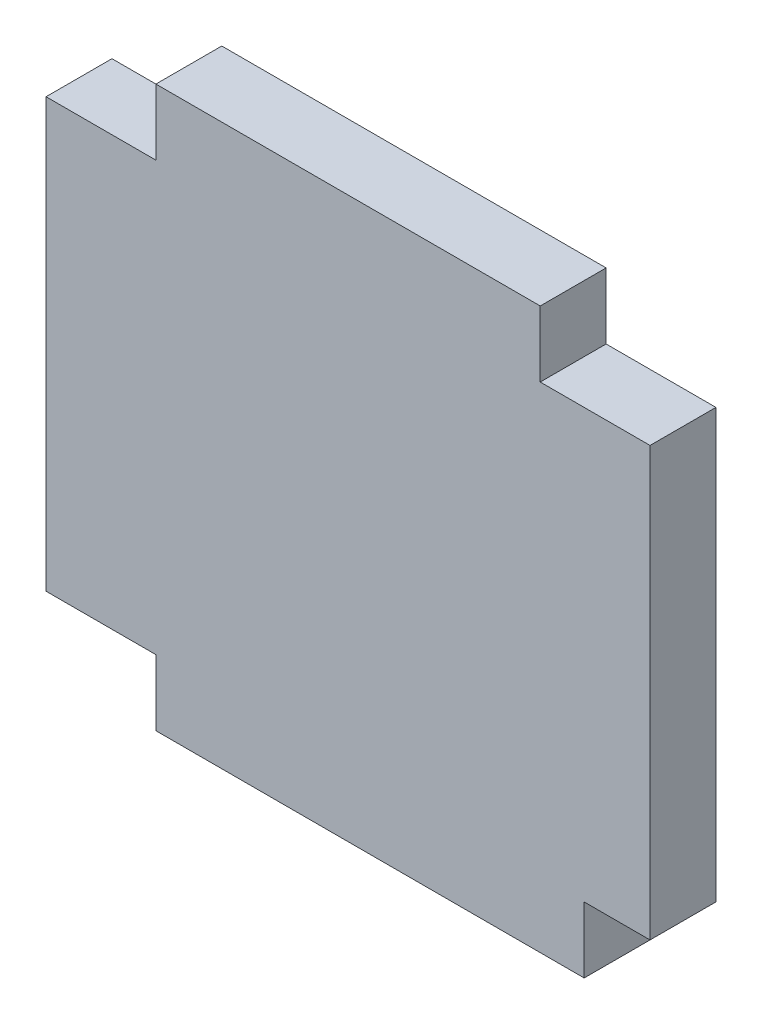
ISO-10303-21;
HEADER;
FILE_DESCRIPTION(('STEP AP214'),'2;1');
FILE_NAME('part.step','',(''),(''),'','','');
FILE_SCHEMA(('AUTOMOTIVE_DESIGN { 1 0 10303 214 1 1 1 1 }'));
ENDSEC;
DATA;
#1=APPLICATION_CONTEXT('core data for automotive mechanical design processes');
#2=APPLICATION_PROTOCOL_DEFINITION('international standard','automotive_design',2000,#1);
#3=PRODUCT_CONTEXT('',#1,'mechanical');
#4=PRODUCT('Part','Part','',(#3));
#5=PRODUCT_RELATED_PRODUCT_CATEGORY('part','',(#4));
#6=PRODUCT_DEFINITION_FORMATION('','',#4);
#7=PRODUCT_DEFINITION_CONTEXT('part definition',#1,'design');
#8=PRODUCT_DEFINITION('design','',#6,#7);
#9=PRODUCT_DEFINITION_SHAPE('','',#8);
#10=(LENGTH_UNIT() NAMED_UNIT(*) SI_UNIT(.MILLI.,.METRE.));
#11=(NAMED_UNIT(*) PLANE_ANGLE_UNIT() SI_UNIT($,.RADIAN.));
#12=(NAMED_UNIT(*) SI_UNIT($,.STERADIAN.) SOLID_ANGLE_UNIT());
#13=UNCERTAINTY_MEASURE_WITH_UNIT(LENGTH_MEASURE(1.E-05),#10,'distance_accuracy_value','');
#14=(GEOMETRIC_REPRESENTATION_CONTEXT(3) GLOBAL_UNCERTAINTY_ASSIGNED_CONTEXT((#13)) GLOBAL_UNIT_ASSIGNED_CONTEXT((#10,
#11,#12)) REPRESENTATION_CONTEXT('',''));
#15=CARTESIAN_POINT('',(0.,0.,0.));
#16=DIRECTION('',(0.,0.,1.));
#17=DIRECTION('',(1.,0.,0.));
#18=AXIS2_PLACEMENT_3D('',#15,#16,#17);
#19=CARTESIAN_POINT('',(0.,45.,6.));
#20=DIRECTION('',(1.,0.,0.));
#21=DIRECTION('',(0.,1.,0.));
#22=AXIS2_PLACEMENT_3D('',#19,#20,#21);
#23=PLANE('',#22);
#24=DIRECTION('',(0.,-1.,0.));
#25=VECTOR('',#24,1.);
#26=CARTESIAN_POINT('',(0.,45.,6.));
#27=LINE('',#26,#25);
#28=CARTESIAN_POINT('',(0.,39.,6.));
#29=VERTEX_POINT('',#28);
#30=CARTESIAN_POINT('',(0.,0.,6.));
#31=VERTEX_POINT('',#30);
#32=EDGE_CURVE('E136',#29,#31,#27,.T.);
#33=ORIENTED_EDGE('',*,*,#32,.F.);
#34=DIRECTION('',(0.,0.,1.));
#35=VECTOR('',#34,1.);
#36=CARTESIAN_POINT('',(0.,39.,0.));
#37=LINE('',#36,#35);
#38=CARTESIAN_POINT('',(0.,39.,0.));
#39=VERTEX_POINT('',#38);
#40=EDGE_CURVE('E124',#39,#29,#37,.T.);
#41=ORIENTED_EDGE('',*,*,#40,.F.);
#42=DIRECTION('',(0.,-1.,0.));
#43=VECTOR('',#42,1.);
#44=CARTESIAN_POINT('',(0.,45.,0.));
#45=LINE('',#44,#43);
#46=CARTESIAN_POINT('',(0.,0.,0.));
#47=VERTEX_POINT('',#46);
#48=EDGE_CURVE('E134',#39,#47,#45,.T.);
#49=ORIENTED_EDGE('',*,*,#48,.T.);
#50=DIRECTION('',(0.,0.,-1.));
#51=VECTOR('',#50,1.);
#52=CARTESIAN_POINT('',(0.,0.,6.));
#53=LINE('',#52,#51);
#54=EDGE_CURVE('E11',#31,#47,#53,.T.);
#55=ORIENTED_EDGE('',*,*,#54,.F.);
#56=EDGE_LOOP('',(#33,#41,#49,#55));
#57=FACE_BOUND('',#56,.T.);
#58=ADVANCED_FACE('F33',(#57),#23,.F.);
#59=CARTESIAN_POINT('',(0.,0.,6.));
#60=DIRECTION('',(0.,1.,0.));
#61=DIRECTION('',(0.,0.,1.));
#62=AXIS2_PLACEMENT_3D('',#59,#60,#61);
#63=PLANE('',#62);
#64=DIRECTION('',(1.,0.,0.));
#65=VECTOR('',#64,1.);
#66=CARTESIAN_POINT('',(0.,0.,0.));
#67=LINE('',#66,#65);
#68=CARTESIAN_POINT('',(10.,0.,0.));
#69=VERTEX_POINT('',#68);
#70=EDGE_CURVE('E140',#47,#69,#67,.T.);
#71=ORIENTED_EDGE('',*,*,#70,.T.);
#72=DIRECTION('',(0.,0.,-1.));
#73=VECTOR('',#72,1.);
#74=CARTESIAN_POINT('',(10.,0.,6.));
#75=LINE('',#74,#73);
#76=CARTESIAN_POINT('',(10.,0.,6.));
#77=VERTEX_POINT('',#76);
#78=EDGE_CURVE('E40',#77,#69,#75,.T.);
#79=ORIENTED_EDGE('',*,*,#78,.F.);
#80=DIRECTION('',(1.,0.,0.));
#81=VECTOR('',#80,1.);
#82=CARTESIAN_POINT('',(0.,0.,6.));
#83=LINE('',#82,#81);
#84=EDGE_CURVE('E241',#31,#77,#83,.T.);
#85=ORIENTED_EDGE('',*,*,#84,.F.);
#86=ORIENTED_EDGE('',*,*,#54,.T.);
#87=EDGE_LOOP('',(#71,#79,#85,#86));
#88=FACE_BOUND('',#87,.T.);
#89=ADVANCED_FACE('F242',(#88),#63,.F.);
#90=CARTESIAN_POINT('',(10.,-6.,6.));
#91=DIRECTION('',(1.,0.,0.));
#92=DIRECTION('',(0.,0.,-1.));
#93=AXIS2_PLACEMENT_3D('',#90,#91,#92);
#94=PLANE('',#93);
#95=DIRECTION('',(0.,-1.,0.));
#96=VECTOR('',#95,1.);
#97=CARTESIAN_POINT('',(10.,-6.,0.));
#98=LINE('',#97,#96);
#99=CARTESIAN_POINT('',(10.,-6.,0.));
#100=VERTEX_POINT('',#99);
#101=EDGE_CURVE('E143',#69,#100,#98,.T.);
#102=ORIENTED_EDGE('',*,*,#101,.T.);
#103=DIRECTION('',(0.,0.,-1.));
#104=VECTOR('',#103,1.);
#105=CARTESIAN_POINT('',(10.,-6.,6.));
#106=LINE('',#105,#104);
#107=CARTESIAN_POINT('',(10.,-6.,6.));
#108=VERTEX_POINT('',#107);
#109=EDGE_CURVE('E173',#108,#100,#106,.T.);
#110=ORIENTED_EDGE('',*,*,#109,.F.);
#111=DIRECTION('',(0.,-1.,0.));
#112=VECTOR('',#111,1.);
#113=CARTESIAN_POINT('',(10.,-6.,6.));
#114=LINE('',#113,#112);
#115=EDGE_CURVE('E181',#77,#108,#114,.T.);
#116=ORIENTED_EDGE('',*,*,#115,.F.);
#117=ORIENTED_EDGE('',*,*,#78,.T.);
#118=EDGE_LOOP('',(#102,#110,#116,#117));
#119=FACE_BOUND('',#118,.T.);
#120=ADVANCED_FACE('F179',(#119),#94,.F.);
#121=CARTESIAN_POINT('',(10.,-6.,6.));
#122=DIRECTION('',(0.,1.,0.));
#123=DIRECTION('',(0.,0.,1.));
#124=AXIS2_PLACEMENT_3D('',#121,#122,#123);
#125=PLANE('',#124);
#126=DIRECTION('',(1.,0.,0.));
#127=VECTOR('',#126,1.);
#128=CARTESIAN_POINT('',(10.,-6.,0.));
#129=LINE('',#128,#127);
#130=CARTESIAN_POINT('',(49.,-6.,0.));
#131=VERTEX_POINT('',#130);
#132=EDGE_CURVE('E152',#100,#131,#129,.T.);
#133=ORIENTED_EDGE('',*,*,#132,.T.);
#134=DIRECTION('',(0.,0.,-1.));
#135=VECTOR('',#134,1.);
#136=CARTESIAN_POINT('',(49.,-6.,6.));
#137=LINE('',#136,#135);
#138=CARTESIAN_POINT('',(49.,-6.,6.));
#139=VERTEX_POINT('',#138);
#140=EDGE_CURVE('E170',#139,#131,#137,.T.);
#141=ORIENTED_EDGE('',*,*,#140,.F.);
#142=DIRECTION('',(1.,0.,0.));
#143=VECTOR('',#142,1.);
#144=CARTESIAN_POINT('',(10.,-6.,6.));
#145=LINE('',#144,#143);
#146=EDGE_CURVE('E199',#108,#139,#145,.T.);
#147=ORIENTED_EDGE('',*,*,#146,.F.);
#148=ORIENTED_EDGE('',*,*,#109,.T.);
#149=EDGE_LOOP('',(#133,#141,#147,#148));
#150=FACE_BOUND('',#149,.T.);
#151=ADVANCED_FACE('F189',(#150),#125,.F.);
#152=CARTESIAN_POINT('',(49.,-6.,6.));
#153=DIRECTION('',(-1.,0.,0.));
#154=DIRECTION('',(0.,0.,1.));
#155=AXIS2_PLACEMENT_3D('',#152,#153,#154);
#156=PLANE('',#155);
#157=DIRECTION('',(0.,1.,0.));
#158=VECTOR('',#157,1.);
#159=CARTESIAN_POINT('',(49.,-6.,0.));
#160=LINE('',#159,#158);
#161=CARTESIAN_POINT('',(49.,0.,0.));
#162=VERTEX_POINT('',#161);
#163=EDGE_CURVE('E154',#131,#162,#160,.T.);
#164=ORIENTED_EDGE('',*,*,#163,.T.);
#165=DIRECTION('',(0.,0.,-1.));
#166=VECTOR('',#165,1.);
#167=CARTESIAN_POINT('',(49.,0.,6.));
#168=LINE('',#167,#166);
#169=CARTESIAN_POINT('',(49.,0.,6.));
#170=VERTEX_POINT('',#169);
#171=EDGE_CURVE('E167',#170,#162,#168,.T.);
#172=ORIENTED_EDGE('',*,*,#171,.F.);
#173=DIRECTION('',(0.,1.,0.));
#174=VECTOR('',#173,1.);
#175=CARTESIAN_POINT('',(49.,-6.,6.));
#176=LINE('',#175,#174);
#177=EDGE_CURVE('E195',#139,#170,#176,.T.);
#178=ORIENTED_EDGE('',*,*,#177,.F.);
#179=ORIENTED_EDGE('',*,*,#140,.T.);
#180=EDGE_LOOP('',(#164,#172,#178,#179));
#181=FACE_BOUND('',#180,.T.);
#182=ADVANCED_FACE('F193',(#181),#156,.F.);
#183=CARTESIAN_POINT('',(55.,0.,6.));
#184=DIRECTION('',(0.,1.,0.));
#185=DIRECTION('',(-1.,0.,0.));
#186=AXIS2_PLACEMENT_3D('',#183,#184,#185);
#187=PLANE('',#186);
#188=DIRECTION('',(1.,0.,0.));
#189=VECTOR('',#188,1.);
#190=CARTESIAN_POINT('',(55.,0.,0.));
#191=LINE('',#190,#189);
#192=CARTESIAN_POINT('',(55.,0.,0.));
#193=VERTEX_POINT('',#192);
#194=EDGE_CURVE('E156',#162,#193,#191,.T.);
#195=ORIENTED_EDGE('',*,*,#194,.T.);
#196=DIRECTION('',(0.,0.,-1.));
#197=VECTOR('',#196,1.);
#198=CARTESIAN_POINT('',(55.,0.,6.));
#199=LINE('',#198,#197);
#200=CARTESIAN_POINT('',(55.,0.,6.));
#201=VERTEX_POINT('',#200);
#202=EDGE_CURVE('E164',#201,#193,#199,.T.);
#203=ORIENTED_EDGE('',*,*,#202,.F.);
#204=DIRECTION('',(1.,0.,0.));
#205=VECTOR('',#204,1.);
#206=CARTESIAN_POINT('',(55.,0.,6.));
#207=LINE('',#206,#205);
#208=EDGE_CURVE('E198',#170,#201,#207,.T.);
#209=ORIENTED_EDGE('',*,*,#208,.F.);
#210=ORIENTED_EDGE('',*,*,#171,.T.);
#211=EDGE_LOOP('',(#195,#203,#209,#210));
#212=FACE_BOUND('',#211,.T.);
#213=ADVANCED_FACE('F255',(#212),#187,.F.);
#214=CARTESIAN_POINT('',(55.,45.,6.));
#215=DIRECTION('',(-1.,0.,0.));
#216=DIRECTION('',(0.,-1.,0.));
#217=AXIS2_PLACEMENT_3D('',#214,#215,#216);
#218=PLANE('',#217);
#219=DIRECTION('',(0.,1.,0.));
#220=VECTOR('',#219,1.);
#221=CARTESIAN_POINT('',(55.,45.,0.));
#222=LINE('',#221,#220);
#223=CARTESIAN_POINT('',(55.,39.,0.));
#224=VERTEX_POINT('',#223);
#225=EDGE_CURVE('E158',#193,#224,#222,.T.);
#226=ORIENTED_EDGE('',*,*,#225,.T.);
#227=DIRECTION('',(0.,0.,1.));
#228=VECTOR('',#227,1.);
#229=CARTESIAN_POINT('',(55.,39.,0.));
#230=LINE('',#229,#228);
#231=CARTESIAN_POINT('',(55.,39.,6.));
#232=VERTEX_POINT('',#231);
#233=EDGE_CURVE('E226',#224,#232,#230,.T.);
#234=ORIENTED_EDGE('',*,*,#233,.T.);
#235=DIRECTION('',(0.,1.,0.));
#236=VECTOR('',#235,1.);
#237=CARTESIAN_POINT('',(55.,45.,6.));
#238=LINE('',#237,#236);
#239=EDGE_CURVE('E201',#201,#232,#238,.T.);
#240=ORIENTED_EDGE('',*,*,#239,.F.);
#241=ORIENTED_EDGE('',*,*,#202,.T.);
#242=EDGE_LOOP('',(#226,#234,#240,#241));
#243=FACE_BOUND('',#242,.T.);
#244=ADVANCED_FACE('F258',(#243),#218,.F.);
#245=CARTESIAN_POINT('',(0.,45.,6.));
#246=DIRECTION('',(0.,-1.,0.));
#247=DIRECTION('',(0.,0.,-1.));
#248=AXIS2_PLACEMENT_3D('',#245,#246,#247);
#249=PLANE('',#248);
#250=DIRECTION('',(-1.,0.,0.));
#251=VECTOR('',#250,1.);
#252=CARTESIAN_POINT('',(0.,45.,0.));
#253=LINE('',#252,#251);
#254=CARTESIAN_POINT('',(45.,45.,0.));
#255=VERTEX_POINT('',#254);
#256=CARTESIAN_POINT('',(10.,45.,0.));
#257=VERTEX_POINT('',#256);
#258=EDGE_CURVE('E161',#255,#257,#253,.T.);
#259=ORIENTED_EDGE('',*,*,#258,.T.);
#260=DIRECTION('',(0.,0.,1.));
#261=VECTOR('',#260,1.);
#262=CARTESIAN_POINT('',(10.,45.,0.));
#263=LINE('',#262,#261);
#264=CARTESIAN_POINT('',(10.,45.,6.));
#265=VERTEX_POINT('',#264);
#266=EDGE_CURVE('E141',#257,#265,#263,.T.);
#267=ORIENTED_EDGE('',*,*,#266,.T.);
#268=DIRECTION('',(-1.,0.,0.));
#269=VECTOR('',#268,1.);
#270=CARTESIAN_POINT('',(0.,45.,6.));
#271=LINE('',#270,#269);
#272=CARTESIAN_POINT('',(45.,45.,6.));
#273=VERTEX_POINT('',#272);
#274=EDGE_CURVE('E148',#273,#265,#271,.T.);
#275=ORIENTED_EDGE('',*,*,#274,.F.);
#276=DIRECTION('',(0.,0.,1.));
#277=VECTOR('',#276,1.);
#278=CARTESIAN_POINT('',(45.,45.,0.));
#279=LINE('',#278,#277);
#280=EDGE_CURVE('E218',#255,#273,#279,.T.);
#281=ORIENTED_EDGE('',*,*,#280,.F.);
#282=EDGE_LOOP('',(#259,#267,#275,#281));
#283=FACE_BOUND('',#282,.T.);
#284=ADVANCED_FACE('F217',(#283),#249,.F.);
#285=CARTESIAN_POINT('',(0.,0.,6.));
#286=DIRECTION('',(0.,0.,1.));
#287=DIRECTION('',(1.,0.,0.));
#288=AXIS2_PLACEMENT_3D('',#285,#286,#287);
#289=PLANE('',#288);
#290=DIRECTION('',(0.,1.,0.));
#291=VECTOR('',#290,1.);
#292=CARTESIAN_POINT('',(10.,45.,6.));
#293=LINE('',#292,#291);
#294=CARTESIAN_POINT('',(10.,39.,6.));
#295=VERTEX_POINT('',#294);
#296=EDGE_CURVE('E129',#295,#265,#293,.T.);
#297=ORIENTED_EDGE('',*,*,#296,.F.);
#298=DIRECTION('',(1.,0.,0.));
#299=VECTOR('',#298,1.);
#300=CARTESIAN_POINT('',(0.,39.,6.));
#301=LINE('',#300,#299);
#302=EDGE_CURVE('E224',#29,#295,#301,.T.);
#303=ORIENTED_EDGE('',*,*,#302,.F.);
#304=ORIENTED_EDGE('',*,*,#32,.T.);
#305=ORIENTED_EDGE('',*,*,#84,.T.);
#306=ORIENTED_EDGE('',*,*,#115,.T.);
#307=ORIENTED_EDGE('',*,*,#146,.T.);
#308=ORIENTED_EDGE('',*,*,#177,.T.);
#309=ORIENTED_EDGE('',*,*,#208,.T.);
#310=ORIENTED_EDGE('',*,*,#239,.T.);
#311=DIRECTION('',(1.,0.,0.));
#312=VECTOR('',#311,1.);
#313=CARTESIAN_POINT('',(55.,39.,6.));
#314=LINE('',#313,#312);
#315=CARTESIAN_POINT('',(45.,39.,6.));
#316=VERTEX_POINT('',#315);
#317=EDGE_CURVE('E231',#316,#232,#314,.T.);
#318=ORIENTED_EDGE('',*,*,#317,.F.);
#319=DIRECTION('',(0.,-1.,0.));
#320=VECTOR('',#319,1.);
#321=CARTESIAN_POINT('',(45.,45.,6.));
#322=LINE('',#321,#320);
#323=EDGE_CURVE('E214',#273,#316,#322,.T.);
#324=ORIENTED_EDGE('',*,*,#323,.F.);
#325=ORIENTED_EDGE('',*,*,#274,.T.);
#326=EDGE_LOOP('',(#297,#303,#304,#305,#306,#307,#308,#309,#310,#318,#324,#325));
#327=FACE_BOUND('',#326,.T.);
#328=ADVANCED_FACE('F212',(#327),#289,.T.);
#329=CARTESIAN_POINT('',(0.,0.,0.));
#330=DIRECTION('',(0.,0.,1.));
#331=DIRECTION('',(1.,0.,0.));
#332=AXIS2_PLACEMENT_3D('',#329,#330,#331);
#333=PLANE('',#332);
#334=DIRECTION('',(1.,0.,0.));
#335=VECTOR('',#334,1.);
#336=CARTESIAN_POINT('',(0.,39.,0.));
#337=LINE('',#336,#335);
#338=CARTESIAN_POINT('',(10.,39.,0.));
#339=VERTEX_POINT('',#338);
#340=EDGE_CURVE('E120',#39,#339,#337,.T.);
#341=ORIENTED_EDGE('',*,*,#340,.T.);
#342=DIRECTION('',(0.,1.,0.));
#343=VECTOR('',#342,1.);
#344=CARTESIAN_POINT('',(10.,45.,0.));
#345=LINE('',#344,#343);
#346=EDGE_CURVE('E47',#339,#257,#345,.T.);
#347=ORIENTED_EDGE('',*,*,#346,.T.);
#348=ORIENTED_EDGE('',*,*,#258,.F.);
#349=DIRECTION('',(0.,-1.,0.));
#350=VECTOR('',#349,1.);
#351=CARTESIAN_POINT('',(45.,45.,0.));
#352=LINE('',#351,#350);
#353=CARTESIAN_POINT('',(45.,39.,0.));
#354=VERTEX_POINT('',#353);
#355=EDGE_CURVE('E229',#255,#354,#352,.T.);
#356=ORIENTED_EDGE('',*,*,#355,.T.);
#357=DIRECTION('',(1.,0.,0.));
#358=VECTOR('',#357,1.);
#359=CARTESIAN_POINT('',(55.,39.,0.));
#360=LINE('',#359,#358);
#361=EDGE_CURVE('E55',#354,#224,#360,.T.);
#362=ORIENTED_EDGE('',*,*,#361,.T.);
#363=ORIENTED_EDGE('',*,*,#225,.F.);
#364=ORIENTED_EDGE('',*,*,#194,.F.);
#365=ORIENTED_EDGE('',*,*,#163,.F.);
#366=ORIENTED_EDGE('',*,*,#132,.F.);
#367=ORIENTED_EDGE('',*,*,#101,.F.);
#368=ORIENTED_EDGE('',*,*,#70,.F.);
#369=ORIENTED_EDGE('',*,*,#48,.F.);
#370=EDGE_LOOP('',(#341,#347,#348,#356,#362,#363,#364,#365,#366,#367,#368,#369));
#371=FACE_BOUND('',#370,.T.);
#372=ADVANCED_FACE('F138',(#371),#333,.F.);
#373=CARTESIAN_POINT('',(55.,39.,0.));
#374=DIRECTION('',(0.,-1.,0.));
#375=DIRECTION('',(0.,0.,-1.));
#376=AXIS2_PLACEMENT_3D('',#373,#374,#375);
#377=PLANE('',#376);
#378=ORIENTED_EDGE('',*,*,#317,.T.);
#379=ORIENTED_EDGE('',*,*,#233,.F.);
#380=ORIENTED_EDGE('',*,*,#361,.F.);
#381=DIRECTION('',(0.,0.,1.));
#382=VECTOR('',#381,1.);
#383=CARTESIAN_POINT('',(45.,39.,0.));
#384=LINE('',#383,#382);
#385=EDGE_CURVE('E237',#354,#316,#384,.T.);
#386=ORIENTED_EDGE('',*,*,#385,.T.);
#387=EDGE_LOOP('',(#378,#379,#380,#386));
#388=FACE_BOUND('',#387,.T.);
#389=ADVANCED_FACE('F267',(#388),#377,.F.);
#390=CARTESIAN_POINT('',(45.,45.,0.));
#391=DIRECTION('',(-1.,0.,0.));
#392=DIRECTION('',(0.,0.,1.));
#393=AXIS2_PLACEMENT_3D('',#390,#391,#392);
#394=PLANE('',#393);
#395=ORIENTED_EDGE('',*,*,#323,.T.);
#396=ORIENTED_EDGE('',*,*,#385,.F.);
#397=ORIENTED_EDGE('',*,*,#355,.F.);
#398=ORIENTED_EDGE('',*,*,#280,.T.);
#399=EDGE_LOOP('',(#395,#396,#397,#398));
#400=FACE_BOUND('',#399,.T.);
#401=ADVANCED_FACE('F270',(#400),#394,.F.);
#402=CARTESIAN_POINT('',(10.,45.,0.));
#403=DIRECTION('',(1.,0.,0.));
#404=DIRECTION('',(0.,0.,-1.));
#405=AXIS2_PLACEMENT_3D('',#402,#403,#404);
#406=PLANE('',#405);
#407=ORIENTED_EDGE('',*,*,#296,.T.);
#408=ORIENTED_EDGE('',*,*,#266,.F.);
#409=ORIENTED_EDGE('',*,*,#346,.F.);
#410=DIRECTION('',(0.,0.,1.));
#411=VECTOR('',#410,1.);
#412=CARTESIAN_POINT('',(10.,39.,0.));
#413=LINE('',#412,#411);
#414=EDGE_CURVE('E126',#339,#295,#413,.T.);
#415=ORIENTED_EDGE('',*,*,#414,.T.);
#416=EDGE_LOOP('',(#407,#408,#409,#415));
#417=FACE_BOUND('',#416,.T.);
#418=ADVANCED_FACE('F220',(#417),#406,.F.);
#419=CARTESIAN_POINT('',(0.,39.,0.));
#420=DIRECTION('',(0.,-1.,0.));
#421=DIRECTION('',(0.,0.,-1.));
#422=AXIS2_PLACEMENT_3D('',#419,#420,#421);
#423=PLANE('',#422);
#424=ORIENTED_EDGE('',*,*,#302,.T.);
#425=ORIENTED_EDGE('',*,*,#414,.F.);
#426=ORIENTED_EDGE('',*,*,#340,.F.);
#427=ORIENTED_EDGE('',*,*,#40,.T.);
#428=EDGE_LOOP('',(#424,#425,#426,#427));
#429=FACE_BOUND('',#428,.T.);
#430=ADVANCED_FACE('F123',(#429),#423,.F.);
#431=CLOSED_SHELL('',(#58,#89,#120,#151,#182,#213,#244,#284,#328,#372,#389,#401,#418,#430));
#432=MANIFOLD_SOLID_BREP('B2',#431);
#433=ADVANCED_BREP_SHAPE_REPRESENTATION('',(#18,#432),#14);
#434=SHAPE_DEFINITION_REPRESENTATION(#9,#433);
ENDSEC;
END-ISO-10303-21;
